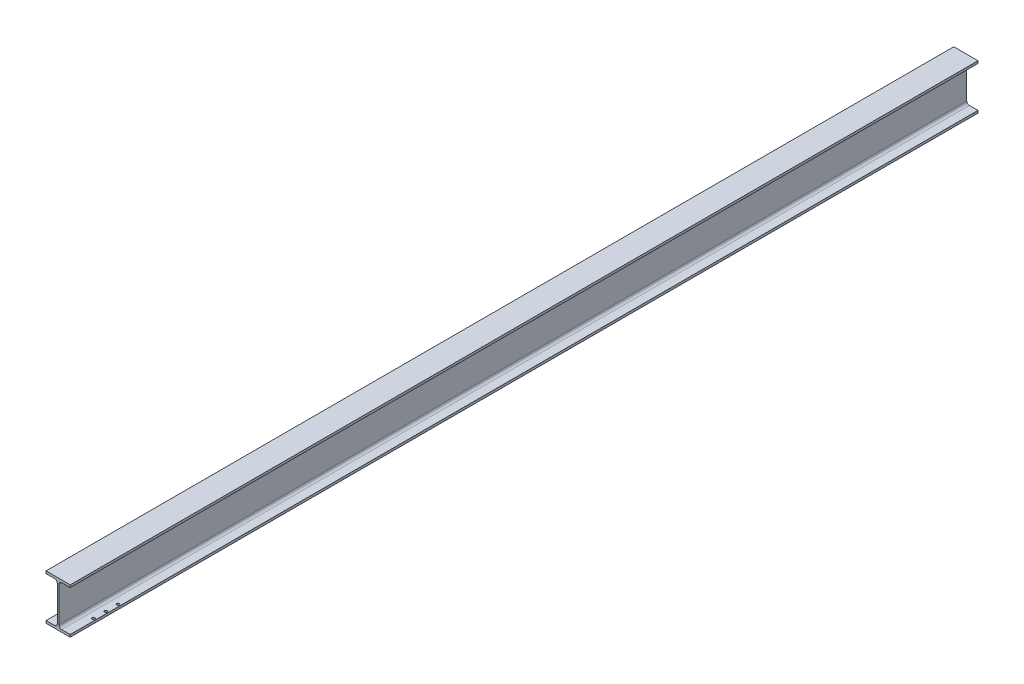
ISO-10303-21;
HEADER;
FILE_DESCRIPTION(('STEP AP214'),'2;1');
FILE_NAME('part.step','',(''),(''),'','','');
FILE_SCHEMA(('AUTOMOTIVE_DESIGN { 1 0 10303 214 1 1 1 1 }'));
ENDSEC;
DATA;
#1=APPLICATION_CONTEXT('core data for automotive mechanical design processes');
#2=APPLICATION_PROTOCOL_DEFINITION('international standard','automotive_design',2000,#1);
#3=PRODUCT_CONTEXT('',#1,'mechanical');
#4=PRODUCT('Part','Part','',(#3));
#5=PRODUCT_RELATED_PRODUCT_CATEGORY('part','',(#4));
#6=PRODUCT_DEFINITION_FORMATION('','',#4);
#7=PRODUCT_DEFINITION_CONTEXT('part definition',#1,'design');
#8=PRODUCT_DEFINITION('design','',#6,#7);
#9=PRODUCT_DEFINITION_SHAPE('','',#8);
#10=(LENGTH_UNIT() NAMED_UNIT(*) SI_UNIT(.MILLI.,.METRE.));
#11=(NAMED_UNIT(*) PLANE_ANGLE_UNIT() SI_UNIT($,.RADIAN.));
#12=(NAMED_UNIT(*) SI_UNIT($,.STERADIAN.) SOLID_ANGLE_UNIT());
#13=UNCERTAINTY_MEASURE_WITH_UNIT(LENGTH_MEASURE(1.E-05),#10,'distance_accuracy_value','');
#14=(GEOMETRIC_REPRESENTATION_CONTEXT(3) GLOBAL_UNCERTAINTY_ASSIGNED_CONTEXT((#13)) GLOBAL_UNIT_ASSIGNED_CONTEXT((#10,
#11,#12)) REPRESENTATION_CONTEXT('',''));
#15=CARTESIAN_POINT('',(0.,0.,0.));
#16=DIRECTION('',(0.,0.,1.));
#17=DIRECTION('',(1.,0.,0.));
#18=AXIS2_PLACEMENT_3D('',#15,#16,#17);
#19=CARTESIAN_POINT('',(0.,-60.,1200.));
#20=DIRECTION('',(0.,1.,0.));
#21=DIRECTION('',(-1.,0.,0.));
#22=AXIS2_PLACEMENT_3D('',#19,#20,#21);
#23=PLANE('',#22);
#24=CARTESIAN_POINT('',(25.9999999999999,-60.,1067.5));
#25=DIRECTION('',(0.,-1.,0.));
#26=DIRECTION('',(0.,0.,-1.));
#27=AXIS2_PLACEMENT_3D('',#24,#25,#26);
#28=CIRCLE('',#27,3.5);
#29=CARTESIAN_POINT('',(25.9999999999999,-60.,1064.));
#30=VERTEX_POINT('',#29);
#31=EDGE_CURVE('E561',#30,#30,#28,.T.);
#32=ORIENTED_EDGE('',*,*,#31,.F.);
#33=EDGE_LOOP('',(#32));
#34=FACE_BOUND('',#33,.T.);
#35=CARTESIAN_POINT('',(25.9999999999999,-60.,1100.));
#36=DIRECTION('',(0.,-1.,0.));
#37=DIRECTION('',(0.,0.,-1.));
#38=AXIS2_PLACEMENT_3D('',#35,#36,#37);
#39=CIRCLE('',#38,3.5);
#40=CARTESIAN_POINT('',(25.9999999999999,-60.,1096.5));
#41=VERTEX_POINT('',#40);
#42=EDGE_CURVE('E575',#41,#41,#39,.T.);
#43=ORIENTED_EDGE('',*,*,#42,.F.);
#44=EDGE_LOOP('',(#43));
#45=FACE_BOUND('',#44,.T.);
#46=DIRECTION('',(1.,0.,0.));
#47=VECTOR('',#46,1.);
#48=CARTESIAN_POINT('',(0.,-60.,-1200.));
#49=LINE('',#48,#47);
#50=CARTESIAN_POINT('',(-32.,-60.,-1200.));
#51=VERTEX_POINT('',#50);
#52=CARTESIAN_POINT('',(32.,-60.,-1200.));
#53=VERTEX_POINT('',#52);
#54=EDGE_CURVE('E163',#51,#53,#49,.T.);
#55=ORIENTED_EDGE('',*,*,#54,.T.);
#56=DIRECTION('',(0.,0.,-1.));
#57=VECTOR('',#56,1.);
#58=CARTESIAN_POINT('',(32.,-60.,1200.));
#59=LINE('',#58,#57);
#60=CARTESIAN_POINT('',(32.,-60.,1200.));
#61=VERTEX_POINT('',#60);
#62=EDGE_CURVE('E160',#61,#53,#59,.T.);
#63=ORIENTED_EDGE('',*,*,#62,.F.);
#64=DIRECTION('',(1.,0.,0.));
#65=VECTOR('',#64,1.);
#66=CARTESIAN_POINT('',(0.,-60.,1200.));
#67=LINE('',#66,#65);
#68=CARTESIAN_POINT('',(-32.,-60.,1200.));
#69=VERTEX_POINT('',#68);
#70=EDGE_CURVE('E145',#69,#61,#67,.T.);
#71=ORIENTED_EDGE('',*,*,#70,.F.);
#72=DIRECTION('',(0.,0.,-1.));
#73=VECTOR('',#72,1.);
#74=CARTESIAN_POINT('',(-32.,-60.,1200.));
#75=LINE('',#74,#73);
#76=EDGE_CURVE('E157',#69,#51,#75,.T.);
#77=ORIENTED_EDGE('',*,*,#76,.T.);
#78=EDGE_LOOP('',(#55,#63,#71,#77));
#79=FACE_BOUND('',#78,.T.);
#80=CARTESIAN_POINT('',(25.9999999999999,-60.,1132.5));
#81=DIRECTION('',(0.,-1.,0.));
#82=DIRECTION('',(0.,0.,-1.));
#83=AXIS2_PLACEMENT_3D('',#80,#81,#82);
#84=CIRCLE('',#83,3.5);
#85=CARTESIAN_POINT('',(25.9999999999999,-60.,1129.));
#86=VERTEX_POINT('',#85);
#87=EDGE_CURVE('E586',#86,#86,#84,.T.);
#88=ORIENTED_EDGE('',*,*,#87,.F.);
#89=EDGE_LOOP('',(#88));
#90=FACE_BOUND('',#89,.T.);
#91=CARTESIAN_POINT('',(-26.0000000000001,-60.,1132.5));
#92=DIRECTION('',(0.,-1.,0.));
#93=DIRECTION('',(0.,0.,-1.));
#94=AXIS2_PLACEMENT_3D('',#91,#92,#93);
#95=CIRCLE('',#94,3.5);
#96=CARTESIAN_POINT('',(-26.0000000000001,-60.,1129.));
#97=VERTEX_POINT('',#96);
#98=EDGE_CURVE('E581',#97,#97,#95,.T.);
#99=ORIENTED_EDGE('',*,*,#98,.F.);
#100=EDGE_LOOP('',(#99));
#101=FACE_BOUND('',#100,.T.);
#102=CARTESIAN_POINT('',(-26.0000000000001,-60.,1100.));
#103=DIRECTION('',(0.,-1.,0.));
#104=DIRECTION('',(0.,0.,-1.));
#105=AXIS2_PLACEMENT_3D('',#102,#103,#104);
#106=CIRCLE('',#105,3.5);
#107=CARTESIAN_POINT('',(-26.0000000000001,-60.,1096.5));
#108=VERTEX_POINT('',#107);
#109=EDGE_CURVE('E569',#108,#108,#106,.T.);
#110=ORIENTED_EDGE('',*,*,#109,.F.);
#111=EDGE_LOOP('',(#110));
#112=FACE_BOUND('',#111,.T.);
#113=CARTESIAN_POINT('',(-26.0000000000001,-60.,1067.5));
#114=DIRECTION('',(0.,-1.,0.));
#115=DIRECTION('',(0.,0.,-1.));
#116=AXIS2_PLACEMENT_3D('',#113,#114,#115);
#117=CIRCLE('',#116,3.5);
#118=CARTESIAN_POINT('',(-26.0000000000001,-60.,1064.));
#119=VERTEX_POINT('',#118);
#120=EDGE_CURVE('E558',#119,#119,#117,.T.);
#121=ORIENTED_EDGE('',*,*,#120,.F.);
#122=EDGE_LOOP('',(#121));
#123=FACE_BOUND('',#122,.T.);
#124=ADVANCED_FACE('F34',(#34,#45,#79,#90,#101,#112,#123),#23,.F.);
#125=CARTESIAN_POINT('',(-32.,60.,1200.));
#126=DIRECTION('',(0.,-1.,0.));
#127=DIRECTION('',(1.,0.,0.));
#128=AXIS2_PLACEMENT_3D('',#125,#126,#127);
#129=PLANE('',#128);
#130=DIRECTION('',(-1.,0.,0.));
#131=VECTOR('',#130,1.);
#132=CARTESIAN_POINT('',(-32.,60.,-1200.));
#133=LINE('',#132,#131);
#134=CARTESIAN_POINT('',(32.,60.,-1200.));
#135=VERTEX_POINT('',#134);
#136=CARTESIAN_POINT('',(-32.,60.,-1200.));
#137=VERTEX_POINT('',#136);
#138=EDGE_CURVE('E167',#135,#137,#133,.T.);
#139=ORIENTED_EDGE('',*,*,#138,.T.);
#140=DIRECTION('',(0.,0.,-1.));
#141=VECTOR('',#140,1.);
#142=CARTESIAN_POINT('',(-32.,60.,1200.));
#143=LINE('',#142,#141);
#144=CARTESIAN_POINT('',(-32.,60.,1200.));
#145=VERTEX_POINT('',#144);
#146=EDGE_CURVE('E242',#145,#137,#143,.T.);
#147=ORIENTED_EDGE('',*,*,#146,.F.);
#148=DIRECTION('',(-1.,0.,0.));
#149=VECTOR('',#148,1.);
#150=CARTESIAN_POINT('',(-32.,60.,1200.));
#151=LINE('',#150,#149);
#152=CARTESIAN_POINT('',(32.,60.,1200.));
#153=VERTEX_POINT('',#152);
#154=EDGE_CURVE('E208',#153,#145,#151,.T.);
#155=ORIENTED_EDGE('',*,*,#154,.F.);
#156=DIRECTION('',(0.,0.,-1.));
#157=VECTOR('',#156,1.);
#158=CARTESIAN_POINT('',(32.,60.,1200.));
#159=LINE('',#158,#157);
#160=EDGE_CURVE('E193',#153,#135,#159,.T.);
#161=ORIENTED_EDGE('',*,*,#160,.T.);
#162=EDGE_LOOP('',(#139,#147,#155,#161));
#163=FACE_BOUND('',#162,.T.);
#164=ADVANCED_FACE('F316',(#163),#129,.F.);
#165=CARTESIAN_POINT('',(-32.,53.7,1200.));
#166=DIRECTION('',(1.,0.,0.));
#167=DIRECTION('',(0.,0.,-1.));
#168=AXIS2_PLACEMENT_3D('',#165,#166,#167);
#169=PLANE('',#168);
#170=DIRECTION('',(0.,-1.,0.));
#171=VECTOR('',#170,1.);
#172=CARTESIAN_POINT('',(-32.,53.7,-1200.));
#173=LINE('',#172,#171);
#174=CARTESIAN_POINT('',(-32.,53.7,-1200.));
#175=VERTEX_POINT('',#174);
#176=EDGE_CURVE('E222',#137,#175,#173,.T.);
#177=ORIENTED_EDGE('',*,*,#176,.T.);
#178=DIRECTION('',(0.,0.,-1.));
#179=VECTOR('',#178,1.);
#180=CARTESIAN_POINT('',(-32.,53.7,1200.));
#181=LINE('',#180,#179);
#182=CARTESIAN_POINT('',(-32.,53.7,1200.));
#183=VERTEX_POINT('',#182);
#184=EDGE_CURVE('E239',#183,#175,#181,.T.);
#185=ORIENTED_EDGE('',*,*,#184,.F.);
#186=DIRECTION('',(0.,-1.,0.));
#187=VECTOR('',#186,1.);
#188=CARTESIAN_POINT('',(-32.,53.7,1200.));
#189=LINE('',#188,#187);
#190=EDGE_CURVE('E210',#145,#183,#189,.T.);
#191=ORIENTED_EDGE('',*,*,#190,.F.);
#192=ORIENTED_EDGE('',*,*,#146,.T.);
#193=EDGE_LOOP('',(#177,#185,#191,#192));
#194=FACE_BOUND('',#193,.T.);
#195=ADVANCED_FACE('F322',(#194),#169,.F.);
#196=CARTESIAN_POINT('',(-2.19999999999999,53.7,1200.));
#197=DIRECTION('',(0.,1.,0.));
#198=DIRECTION('',(0.,0.,1.));
#199=AXIS2_PLACEMENT_3D('',#196,#197,#198);
#200=PLANE('',#199);
#201=DIRECTION('',(1.,0.,0.));
#202=VECTOR('',#201,1.);
#203=CARTESIAN_POINT('',(-2.19999999999999,53.7,-1200.));
#204=LINE('',#203,#202);
#205=CARTESIAN_POINT('',(-9.19999999999999,53.7,-1200.));
#206=VERTEX_POINT('',#205);
#207=EDGE_CURVE('E224',#175,#206,#204,.T.);
#208=ORIENTED_EDGE('',*,*,#207,.T.);
#209=DIRECTION('',(0.,0.,-1.));
#210=VECTOR('',#209,1.);
#211=CARTESIAN_POINT('',(-9.19999999999999,53.7,1200.));
#212=LINE('',#211,#210);
#213=CARTESIAN_POINT('',(-9.19999999999999,53.7,1200.));
#214=VERTEX_POINT('',#213);
#215=EDGE_CURVE('E260',#206,#214,#212,.F.);
#216=ORIENTED_EDGE('',*,*,#215,.T.);
#217=DIRECTION('',(1.,0.,0.));
#218=VECTOR('',#217,1.);
#219=CARTESIAN_POINT('',(-2.19999999999999,53.7,1200.));
#220=LINE('',#219,#218);
#221=EDGE_CURVE('E212',#183,#214,#220,.T.);
#222=ORIENTED_EDGE('',*,*,#221,.F.);
#223=ORIENTED_EDGE('',*,*,#184,.T.);
#224=EDGE_LOOP('',(#208,#216,#222,#223));
#225=FACE_BOUND('',#224,.T.);
#226=ADVANCED_FACE('F325',(#225),#200,.F.);
#227=CARTESIAN_POINT('',(-2.19999999999999,-53.7,1200.));
#228=DIRECTION('',(1.,0.,0.));
#229=DIRECTION('',(0.,1.,0.));
#230=AXIS2_PLACEMENT_3D('',#227,#228,#229);
#231=PLANE('',#230);
#232=DIRECTION('',(0.,-1.,0.));
#233=VECTOR('',#232,1.);
#234=CARTESIAN_POINT('',(-2.19999999999999,-53.7,1200.));
#235=LINE('',#234,#233);
#236=CARTESIAN_POINT('',(-2.19999999999999,46.7,1200.));
#237=VERTEX_POINT('',#236);
#238=CARTESIAN_POINT('',(-2.19999999999999,-46.7,1200.));
#239=VERTEX_POINT('',#238);
#240=EDGE_CURVE('E215',#237,#239,#235,.T.);
#241=ORIENTED_EDGE('',*,*,#240,.F.);
#242=DIRECTION('',(0.,0.,-1.));
#243=VECTOR('',#242,1.);
#244=CARTESIAN_POINT('',(-2.19999999999999,46.7,-1200.));
#245=LINE('',#244,#243);
#246=CARTESIAN_POINT('',(-2.19999999999999,46.7,-1200.));
#247=VERTEX_POINT('',#246);
#248=EDGE_CURVE('E257',#237,#247,#245,.T.);
#249=ORIENTED_EDGE('',*,*,#248,.T.);
#250=DIRECTION('',(0.,-1.,0.));
#251=VECTOR('',#250,1.);
#252=CARTESIAN_POINT('',(-2.19999999999999,-53.7,-1200.));
#253=LINE('',#252,#251);
#254=CARTESIAN_POINT('',(-2.19999999999999,-46.7,-1200.));
#255=VERTEX_POINT('',#254);
#256=EDGE_CURVE('E227',#247,#255,#253,.T.);
#257=ORIENTED_EDGE('',*,*,#256,.T.);
#258=DIRECTION('',(0.,0.,-1.));
#259=VECTOR('',#258,1.);
#260=CARTESIAN_POINT('',(-2.19999999999999,-46.7,1200.));
#261=LINE('',#260,#259);
#262=EDGE_CURVE('E255',#255,#239,#261,.F.);
#263=ORIENTED_EDGE('',*,*,#262,.T.);
#264=EDGE_LOOP('',(#241,#249,#257,#263));
#265=FACE_BOUND('',#264,.T.);
#266=ADVANCED_FACE('F282',(#265),#231,.F.);
#267=CARTESIAN_POINT('',(-32.,-53.7,1200.));
#268=DIRECTION('',(0.,-1.,0.));
#269=DIRECTION('',(0.,0.,-1.));
#270=AXIS2_PLACEMENT_3D('',#267,#268,#269);
#271=PLANE('',#270);
#272=CARTESIAN_POINT('',(-26.0000000000001,-53.7,1067.5));
#273=DIRECTION('',(0.,-1.,0.));
#274=DIRECTION('',(0.,0.,-1.));
#275=AXIS2_PLACEMENT_3D('',#272,#273,#274);
#276=CIRCLE('',#275,3.5);
#277=CARTESIAN_POINT('',(-26.0000000000001,-53.7,1064.));
#278=VERTEX_POINT('',#277);
#279=EDGE_CURVE('E555',#278,#278,#276,.T.);
#280=ORIENTED_EDGE('',*,*,#279,.T.);
#281=EDGE_LOOP('',(#280));
#282=FACE_BOUND('',#281,.T.);
#283=CARTESIAN_POINT('',(-26.0000000000001,-53.7,1100.));
#284=DIRECTION('',(0.,-1.,0.));
#285=DIRECTION('',(0.,0.,-1.));
#286=AXIS2_PLACEMENT_3D('',#283,#284,#285);
#287=CIRCLE('',#286,3.5);
#288=CARTESIAN_POINT('',(-26.0000000000001,-53.7,1096.5));
#289=VERTEX_POINT('',#288);
#290=EDGE_CURVE('E572',#289,#289,#287,.T.);
#291=ORIENTED_EDGE('',*,*,#290,.T.);
#292=EDGE_LOOP('',(#291));
#293=FACE_BOUND('',#292,.T.);
#294=CARTESIAN_POINT('',(-26.0000000000001,-53.7,1132.5));
#295=DIRECTION('',(0.,-1.,0.));
#296=DIRECTION('',(0.,0.,-1.));
#297=AXIS2_PLACEMENT_3D('',#294,#295,#296);
#298=CIRCLE('',#297,3.5);
#299=CARTESIAN_POINT('',(-26.0000000000001,-53.7,1129.));
#300=VERTEX_POINT('',#299);
#301=EDGE_CURVE('E584',#300,#300,#298,.T.);
#302=ORIENTED_EDGE('',*,*,#301,.T.);
#303=EDGE_LOOP('',(#302));
#304=FACE_BOUND('',#303,.T.);
#305=DIRECTION('',(-1.,0.,0.));
#306=VECTOR('',#305,1.);
#307=CARTESIAN_POINT('',(-32.,-53.7,1200.));
#308=LINE('',#307,#306);
#309=CARTESIAN_POINT('',(-9.19999999999999,-53.7,1200.));
#310=VERTEX_POINT('',#309);
#311=CARTESIAN_POINT('',(-32.,-53.7,1200.));
#312=VERTEX_POINT('',#311);
#313=EDGE_CURVE('E217',#310,#312,#308,.T.);
#314=ORIENTED_EDGE('',*,*,#313,.F.);
#315=DIRECTION('',(0.,0.,-1.));
#316=VECTOR('',#315,1.);
#317=CARTESIAN_POINT('',(-9.19999999999999,-53.7,-1200.));
#318=LINE('',#317,#316);
#319=CARTESIAN_POINT('',(-9.19999999999999,-53.7,-1200.));
#320=VERTEX_POINT('',#319);
#321=EDGE_CURVE('E262',#310,#320,#318,.T.);
#322=ORIENTED_EDGE('',*,*,#321,.T.);
#323=DIRECTION('',(-1.,0.,0.));
#324=VECTOR('',#323,1.);
#325=CARTESIAN_POINT('',(-32.,-53.7,-1200.));
#326=LINE('',#325,#324);
#327=CARTESIAN_POINT('',(-32.,-53.7,-1200.));
#328=VERTEX_POINT('',#327);
#329=EDGE_CURVE('E230',#320,#328,#326,.T.);
#330=ORIENTED_EDGE('',*,*,#329,.T.);
#331=DIRECTION('',(0.,0.,-1.));
#332=VECTOR('',#331,1.);
#333=CARTESIAN_POINT('',(-32.,-53.7,1200.));
#334=LINE('',#333,#332);
#335=EDGE_CURVE('E236',#312,#328,#334,.T.);
#336=ORIENTED_EDGE('',*,*,#335,.F.);
#337=EDGE_LOOP('',(#314,#322,#330,#336));
#338=FACE_BOUND('',#337,.T.);
#339=ADVANCED_FACE('F285',(#282,#293,#304,#338),#271,.F.);
#340=CARTESIAN_POINT('',(-32.,-60.,1200.));
#341=DIRECTION('',(1.,0.,0.));
#342=DIRECTION('',(0.,0.,-1.));
#343=AXIS2_PLACEMENT_3D('',#340,#341,#342);
#344=PLANE('',#343);
#345=DIRECTION('',(0.,-1.,0.));
#346=VECTOR('',#345,1.);
#347=CARTESIAN_POINT('',(-32.,-60.,-1200.));
#348=LINE('',#347,#346);
#349=EDGE_CURVE('E232',#328,#51,#348,.T.);
#350=ORIENTED_EDGE('',*,*,#349,.T.);
#351=ORIENTED_EDGE('',*,*,#76,.F.);
#352=DIRECTION('',(0.,-1.,0.));
#353=VECTOR('',#352,1.);
#354=CARTESIAN_POINT('',(-32.,-60.,1200.));
#355=LINE('',#354,#353);
#356=EDGE_CURVE('E153',#312,#69,#355,.T.);
#357=ORIENTED_EDGE('',*,*,#356,.F.);
#358=ORIENTED_EDGE('',*,*,#335,.T.);
#359=EDGE_LOOP('',(#350,#351,#357,#358));
#360=FACE_BOUND('',#359,.T.);
#361=ADVANCED_FACE('F288',(#360),#344,.F.);
#362=CARTESIAN_POINT('',(0.,0.,1200.));
#363=DIRECTION('',(0.,0.,-1.));
#364=DIRECTION('',(-1.,0.,0.));
#365=AXIS2_PLACEMENT_3D('',#362,#363,#364);
#366=PLANE('',#365);
#367=ORIENTED_EDGE('',*,*,#154,.T.);
#368=ORIENTED_EDGE('',*,*,#190,.T.);
#369=ORIENTED_EDGE('',*,*,#221,.T.);
#370=CARTESIAN_POINT('',(-9.19999999999999,46.7,1200.));
#371=DIRECTION('',(0.,0.,-1.));
#372=DIRECTION('',(-1.,0.,0.));
#373=AXIS2_PLACEMENT_3D('',#370,#371,#372);
#374=CIRCLE('',#373,7.);
#375=EDGE_CURVE('E274',#214,#237,#374,.T.);
#376=ORIENTED_EDGE('',*,*,#375,.T.);
#377=ORIENTED_EDGE('',*,*,#240,.T.);
#378=CARTESIAN_POINT('',(-9.19999999999999,-46.7,1200.));
#379=DIRECTION('',(0.,0.,-1.));
#380=DIRECTION('',(-1.,0.,0.));
#381=AXIS2_PLACEMENT_3D('',#378,#379,#380);
#382=CIRCLE('',#381,7.);
#383=EDGE_CURVE('E11',#239,#310,#382,.T.);
#384=ORIENTED_EDGE('',*,*,#383,.T.);
#385=ORIENTED_EDGE('',*,*,#313,.T.);
#386=ORIENTED_EDGE('',*,*,#356,.T.);
#387=ORIENTED_EDGE('',*,*,#70,.T.);
#388=DIRECTION('',(0.,-1.,0.));
#389=VECTOR('',#388,1.);
#390=CARTESIAN_POINT('',(32.,-60.,1200.));
#391=LINE('',#390,#389);
#392=CARTESIAN_POINT('',(32.,-53.7,1200.));
#393=VERTEX_POINT('',#392);
#394=EDGE_CURVE('E151',#393,#61,#391,.T.);
#395=ORIENTED_EDGE('',*,*,#394,.F.);
#396=DIRECTION('',(1.,0.,0.));
#397=VECTOR('',#396,1.);
#398=CARTESIAN_POINT('',(32.,-53.7,1200.));
#399=LINE('',#398,#397);
#400=CARTESIAN_POINT('',(9.20000000000001,-53.7,1200.));
#401=VERTEX_POINT('',#400);
#402=EDGE_CURVE('E173',#401,#393,#399,.T.);
#403=ORIENTED_EDGE('',*,*,#402,.F.);
#404=CARTESIAN_POINT('',(9.2,-46.7,1200.));
#405=DIRECTION('',(0.,0.,-1.));
#406=DIRECTION('',(-1.,0.,0.));
#407=AXIS2_PLACEMENT_3D('',#404,#405,#406);
#408=CIRCLE('',#407,7.);
#409=CARTESIAN_POINT('',(2.2,-46.7,1200.));
#410=VERTEX_POINT('',#409);
#411=EDGE_CURVE('E266',#401,#410,#408,.T.);
#412=ORIENTED_EDGE('',*,*,#411,.T.);
#413=DIRECTION('',(0.,-1.,0.));
#414=VECTOR('',#413,1.);
#415=CARTESIAN_POINT('',(2.2,-53.7,1200.));
#416=LINE('',#415,#414);
#417=CARTESIAN_POINT('',(2.19999999999997,46.7,1200.));
#418=VERTEX_POINT('',#417);
#419=EDGE_CURVE('E176',#418,#410,#416,.T.);
#420=ORIENTED_EDGE('',*,*,#419,.F.);
#421=CARTESIAN_POINT('',(9.19999999999997,46.7,1200.));
#422=DIRECTION('',(0.,0.,-1.));
#423=DIRECTION('',(-1.,0.,0.));
#424=AXIS2_PLACEMENT_3D('',#421,#422,#423);
#425=CIRCLE('',#424,7.);
#426=CARTESIAN_POINT('',(9.19999999999997,53.7,1200.));
#427=VERTEX_POINT('',#426);
#428=EDGE_CURVE('E270',#418,#427,#425,.T.);
#429=ORIENTED_EDGE('',*,*,#428,.T.);
#430=DIRECTION('',(-1.,0.,0.));
#431=VECTOR('',#430,1.);
#432=CARTESIAN_POINT('',(2.19999999999997,53.7,1200.));
#433=LINE('',#432,#431);
#434=CARTESIAN_POINT('',(32.,53.7,1200.));
#435=VERTEX_POINT('',#434);
#436=EDGE_CURVE('E187',#435,#427,#433,.T.);
#437=ORIENTED_EDGE('',*,*,#436,.F.);
#438=DIRECTION('',(0.,-1.,0.));
#439=VECTOR('',#438,1.);
#440=CARTESIAN_POINT('',(32.,53.7,1200.));
#441=LINE('',#440,#439);
#442=EDGE_CURVE('E190',#153,#435,#441,.T.);
#443=ORIENTED_EDGE('',*,*,#442,.F.);
#444=EDGE_LOOP('',(#367,#368,#369,#376,#377,#384,#385,#386,#387,#395,#403,#412,#420,#429,#437,#443));
#445=FACE_BOUND('',#444,.T.);
#446=ADVANCED_FACE('F148',(#445),#366,.F.);
#447=CARTESIAN_POINT('',(0.,0.,-1200.));
#448=DIRECTION('',(0.,0.,-1.));
#449=DIRECTION('',(-1.,0.,0.));
#450=AXIS2_PLACEMENT_3D('',#447,#448,#449);
#451=PLANE('',#450);
#452=ORIENTED_EDGE('',*,*,#138,.F.);
#453=DIRECTION('',(0.,-1.,0.));
#454=VECTOR('',#453,1.);
#455=CARTESIAN_POINT('',(32.,53.7,-1200.));
#456=LINE('',#455,#454);
#457=CARTESIAN_POINT('',(32.,53.7,-1200.));
#458=VERTEX_POINT('',#457);
#459=EDGE_CURVE('E174',#135,#458,#456,.T.);
#460=ORIENTED_EDGE('',*,*,#459,.T.);
#461=DIRECTION('',(-1.,0.,0.));
#462=VECTOR('',#461,1.);
#463=CARTESIAN_POINT('',(2.19999999999997,53.7,-1200.));
#464=LINE('',#463,#462);
#465=CARTESIAN_POINT('',(9.19999999999997,53.7,-1200.));
#466=VERTEX_POINT('',#465);
#467=EDGE_CURVE('E179',#458,#466,#464,.T.);
#468=ORIENTED_EDGE('',*,*,#467,.T.);
#469=CARTESIAN_POINT('',(9.19999999999997,46.7,-1200.));
#470=DIRECTION('',(0.,0.,-1.));
#471=DIRECTION('',(-1.,0.,0.));
#472=AXIS2_PLACEMENT_3D('',#469,#470,#471);
#473=CIRCLE('',#472,7.);
#474=CARTESIAN_POINT('',(2.19999999999997,46.7,-1200.));
#475=VERTEX_POINT('',#474);
#476=EDGE_CURVE('E268',#466,#475,#473,.F.);
#477=ORIENTED_EDGE('',*,*,#476,.T.);
#478=DIRECTION('',(0.,-1.,0.));
#479=VECTOR('',#478,1.);
#480=CARTESIAN_POINT('',(2.2,-53.7,-1200.));
#481=LINE('',#480,#479);
#482=CARTESIAN_POINT('',(2.2,-46.7,-1200.));
#483=VERTEX_POINT('',#482);
#484=EDGE_CURVE('E198',#475,#483,#481,.T.);
#485=ORIENTED_EDGE('',*,*,#484,.T.);
#486=CARTESIAN_POINT('',(9.2,-46.7,-1200.));
#487=DIRECTION('',(0.,0.,-1.));
#488=DIRECTION('',(-1.,0.,0.));
#489=AXIS2_PLACEMENT_3D('',#486,#487,#488);
#490=CIRCLE('',#489,7.);
#491=CARTESIAN_POINT('',(9.20000000000001,-53.7,-1200.));
#492=VERTEX_POINT('',#491);
#493=EDGE_CURVE('E264',#483,#492,#490,.F.);
#494=ORIENTED_EDGE('',*,*,#493,.T.);
#495=DIRECTION('',(1.,0.,0.));
#496=VECTOR('',#495,1.);
#497=CARTESIAN_POINT('',(32.,-53.7,-1200.));
#498=LINE('',#497,#496);
#499=CARTESIAN_POINT('',(32.,-53.7,-1200.));
#500=VERTEX_POINT('',#499);
#501=EDGE_CURVE('E196',#492,#500,#498,.T.);
#502=ORIENTED_EDGE('',*,*,#501,.T.);
#503=DIRECTION('',(0.,-1.,0.));
#504=VECTOR('',#503,1.);
#505=CARTESIAN_POINT('',(32.,-60.,-1200.));
#506=LINE('',#505,#504);
#507=EDGE_CURVE('E194',#500,#53,#506,.T.);
#508=ORIENTED_EDGE('',*,*,#507,.T.);
#509=ORIENTED_EDGE('',*,*,#54,.F.);
#510=ORIENTED_EDGE('',*,*,#349,.F.);
#511=ORIENTED_EDGE('',*,*,#329,.F.);
#512=CARTESIAN_POINT('',(-9.19999999999999,-46.7,-1200.));
#513=DIRECTION('',(0.,0.,-1.));
#514=DIRECTION('',(-1.,0.,0.));
#515=AXIS2_PLACEMENT_3D('',#512,#513,#514);
#516=CIRCLE('',#515,7.);
#517=EDGE_CURVE('E42',#320,#255,#516,.F.);
#518=ORIENTED_EDGE('',*,*,#517,.T.);
#519=ORIENTED_EDGE('',*,*,#256,.F.);
#520=CARTESIAN_POINT('',(-9.19999999999999,46.7,-1200.));
#521=DIRECTION('',(0.,0.,-1.));
#522=DIRECTION('',(-1.,0.,0.));
#523=AXIS2_PLACEMENT_3D('',#520,#521,#522);
#524=CIRCLE('',#523,7.);
#525=EDGE_CURVE('E272',#247,#206,#524,.F.);
#526=ORIENTED_EDGE('',*,*,#525,.T.);
#527=ORIENTED_EDGE('',*,*,#207,.F.);
#528=ORIENTED_EDGE('',*,*,#176,.F.);
#529=EDGE_LOOP('',(#452,#460,#468,#477,#485,#494,#502,#508,#509,#510,#511,#518,#519,#526,#527,#528));
#530=FACE_BOUND('',#529,.T.);
#531=ADVANCED_FACE('F278',(#530),#451,.T.);
#532=CARTESIAN_POINT('',(32.,-60.,1200.));
#533=DIRECTION('',(1.,0.,0.));
#534=DIRECTION('',(0.,1.,0.));
#535=AXIS2_PLACEMENT_3D('',#532,#533,#534);
#536=PLANE('',#535);
#537=ORIENTED_EDGE('',*,*,#507,.F.);
#538=DIRECTION('',(0.,0.,-1.));
#539=VECTOR('',#538,1.);
#540=CARTESIAN_POINT('',(32.,-53.7,1200.));
#541=LINE('',#540,#539);
#542=EDGE_CURVE('E168',#393,#500,#541,.T.);
#543=ORIENTED_EDGE('',*,*,#542,.F.);
#544=ORIENTED_EDGE('',*,*,#394,.T.);
#545=ORIENTED_EDGE('',*,*,#62,.T.);
#546=EDGE_LOOP('',(#537,#543,#544,#545));
#547=FACE_BOUND('',#546,.T.);
#548=ADVANCED_FACE('F171',(#547),#536,.T.);
#549=CARTESIAN_POINT('',(32.,-53.7,1200.));
#550=DIRECTION('',(0.,1.,0.));
#551=DIRECTION('',(-1.,0.,0.));
#552=AXIS2_PLACEMENT_3D('',#549,#550,#551);
#553=PLANE('',#552);
#554=CARTESIAN_POINT('',(25.9999999999999,-53.7,1067.5));
#555=DIRECTION('',(0.,1.,0.));
#556=DIRECTION('',(-1.,0.,0.));
#557=AXIS2_PLACEMENT_3D('',#554,#555,#556);
#558=CIRCLE('',#557,3.5);
#559=CARTESIAN_POINT('',(22.4999999999999,-53.7,1067.5));
#560=VERTEX_POINT('',#559);
#561=EDGE_CURVE('E566',#560,#560,#558,.T.);
#562=ORIENTED_EDGE('',*,*,#561,.F.);
#563=EDGE_LOOP('',(#562));
#564=FACE_BOUND('',#563,.T.);
#565=CARTESIAN_POINT('',(25.9999999999999,-53.7,1100.));
#566=DIRECTION('',(0.,1.,0.));
#567=DIRECTION('',(-1.,0.,0.));
#568=AXIS2_PLACEMENT_3D('',#565,#566,#567);
#569=CIRCLE('',#568,3.5);
#570=CARTESIAN_POINT('',(22.4999999999999,-53.7,1100.));
#571=VERTEX_POINT('',#570);
#572=EDGE_CURVE('E578',#571,#571,#569,.T.);
#573=ORIENTED_EDGE('',*,*,#572,.F.);
#574=EDGE_LOOP('',(#573));
#575=FACE_BOUND('',#574,.T.);
#576=CARTESIAN_POINT('',(25.9999999999999,-53.7,1132.5));
#577=DIRECTION('',(0.,1.,0.));
#578=DIRECTION('',(-1.,0.,0.));
#579=AXIS2_PLACEMENT_3D('',#576,#577,#578);
#580=CIRCLE('',#579,3.5);
#581=CARTESIAN_POINT('',(22.4999999999999,-53.7,1132.5));
#582=VERTEX_POINT('',#581);
#583=EDGE_CURVE('E182',#582,#582,#580,.T.);
#584=ORIENTED_EDGE('',*,*,#583,.F.);
#585=EDGE_LOOP('',(#584));
#586=FACE_BOUND('',#585,.T.);
#587=ORIENTED_EDGE('',*,*,#501,.F.);
#588=DIRECTION('',(0.,0.,-1.));
#589=VECTOR('',#588,1.);
#590=CARTESIAN_POINT('',(9.2,-53.7,1200.));
#591=LINE('',#590,#589);
#592=EDGE_CURVE('E250',#492,#401,#591,.F.);
#593=ORIENTED_EDGE('',*,*,#592,.T.);
#594=ORIENTED_EDGE('',*,*,#402,.T.);
#595=ORIENTED_EDGE('',*,*,#542,.T.);
#596=EDGE_LOOP('',(#587,#593,#594,#595));
#597=FACE_BOUND('',#596,.T.);
#598=ADVANCED_FACE('F292',(#564,#575,#586,#597),#553,.T.);
#599=CARTESIAN_POINT('',(2.2,-53.7,1200.));
#600=DIRECTION('',(1.,0.,0.));
#601=DIRECTION('',(0.,1.,0.));
#602=AXIS2_PLACEMENT_3D('',#599,#600,#601);
#603=PLANE('',#602);
#604=ORIENTED_EDGE('',*,*,#419,.T.);
#605=DIRECTION('',(0.,0.,-1.));
#606=VECTOR('',#605,1.);
#607=CARTESIAN_POINT('',(2.2,-46.7,-1200.));
#608=LINE('',#607,#606);
#609=EDGE_CURVE('E247',#410,#483,#608,.T.);
#610=ORIENTED_EDGE('',*,*,#609,.T.);
#611=ORIENTED_EDGE('',*,*,#484,.F.);
#612=DIRECTION('',(0.,0.,-1.));
#613=VECTOR('',#612,1.);
#614=CARTESIAN_POINT('',(2.19999999999997,46.7,1200.));
#615=LINE('',#614,#613);
#616=EDGE_CURVE('E245',#475,#418,#615,.F.);
#617=ORIENTED_EDGE('',*,*,#616,.T.);
#618=EDGE_LOOP('',(#604,#610,#611,#617));
#619=FACE_BOUND('',#618,.T.);
#620=ADVANCED_FACE('F300',(#619),#603,.T.);
#621=CARTESIAN_POINT('',(2.19999999999997,53.7,1200.));
#622=DIRECTION('',(0.,-1.,0.));
#623=DIRECTION('',(1.,0.,0.));
#624=AXIS2_PLACEMENT_3D('',#621,#622,#623);
#625=PLANE('',#624);
#626=ORIENTED_EDGE('',*,*,#436,.T.);
#627=DIRECTION('',(0.,0.,-1.));
#628=VECTOR('',#627,1.);
#629=CARTESIAN_POINT('',(9.19999999999997,53.7,-1200.));
#630=LINE('',#629,#628);
#631=EDGE_CURVE('E252',#427,#466,#630,.T.);
#632=ORIENTED_EDGE('',*,*,#631,.T.);
#633=ORIENTED_EDGE('',*,*,#467,.F.);
#634=DIRECTION('',(0.,0.,-1.));
#635=VECTOR('',#634,1.);
#636=CARTESIAN_POINT('',(32.,53.7,1200.));
#637=LINE('',#636,#635);
#638=EDGE_CURVE('E205',#435,#458,#637,.T.);
#639=ORIENTED_EDGE('',*,*,#638,.F.);
#640=EDGE_LOOP('',(#626,#632,#633,#639));
#641=FACE_BOUND('',#640,.T.);
#642=ADVANCED_FACE('F308',(#641),#625,.T.);
#643=CARTESIAN_POINT('',(32.,53.7,1200.));
#644=DIRECTION('',(1.,0.,0.));
#645=DIRECTION('',(0.,1.,0.));
#646=AXIS2_PLACEMENT_3D('',#643,#644,#645);
#647=PLANE('',#646);
#648=ORIENTED_EDGE('',*,*,#459,.F.);
#649=ORIENTED_EDGE('',*,*,#160,.F.);
#650=ORIENTED_EDGE('',*,*,#442,.T.);
#651=ORIENTED_EDGE('',*,*,#638,.T.);
#652=EDGE_LOOP('',(#648,#649,#650,#651));
#653=FACE_BOUND('',#652,.T.);
#654=ADVANCED_FACE('F314',(#653),#647,.T.);
#655=CARTESIAN_POINT('',(9.2,-46.7,1200.));
#656=DIRECTION('',(0.,0.,1.));
#657=DIRECTION('',(1.,0.,0.));
#658=AXIS2_PLACEMENT_3D('',#655,#656,#657);
#659=CYLINDRICAL_SURFACE('',#658,7.);
#660=ORIENTED_EDGE('',*,*,#411,.F.);
#661=ORIENTED_EDGE('',*,*,#592,.F.);
#662=ORIENTED_EDGE('',*,*,#493,.F.);
#663=ORIENTED_EDGE('',*,*,#609,.F.);
#664=EDGE_LOOP('',(#660,#661,#662,#663));
#665=FACE_BOUND('',#664,.T.);
#666=ADVANCED_FACE('F297',(#665),#659,.F.);
#667=CARTESIAN_POINT('',(9.19999999999997,46.7,1200.));
#668=DIRECTION('',(0.,0.,1.));
#669=DIRECTION('',(1.,0.,0.));
#670=AXIS2_PLACEMENT_3D('',#667,#668,#669);
#671=CYLINDRICAL_SURFACE('',#670,7.);
#672=ORIENTED_EDGE('',*,*,#428,.F.);
#673=ORIENTED_EDGE('',*,*,#616,.F.);
#674=ORIENTED_EDGE('',*,*,#476,.F.);
#675=ORIENTED_EDGE('',*,*,#631,.F.);
#676=EDGE_LOOP('',(#672,#673,#674,#675));
#677=FACE_BOUND('',#676,.T.);
#678=ADVANCED_FACE('F306',(#677),#671,.F.);
#679=CARTESIAN_POINT('',(-9.19999999999999,46.7,1200.));
#680=DIRECTION('',(0.,0.,1.));
#681=DIRECTION('',(1.,0.,0.));
#682=AXIS2_PLACEMENT_3D('',#679,#680,#681);
#683=CYLINDRICAL_SURFACE('',#682,7.);
#684=ORIENTED_EDGE('',*,*,#375,.F.);
#685=ORIENTED_EDGE('',*,*,#215,.F.);
#686=ORIENTED_EDGE('',*,*,#525,.F.);
#687=ORIENTED_EDGE('',*,*,#248,.F.);
#688=EDGE_LOOP('',(#684,#685,#686,#687));
#689=FACE_BOUND('',#688,.T.);
#690=ADVANCED_FACE('F328',(#689),#683,.F.);
#691=CARTESIAN_POINT('',(-9.19999999999999,-46.7,1200.));
#692=DIRECTION('',(0.,0.,1.));
#693=DIRECTION('',(1.,0.,0.));
#694=AXIS2_PLACEMENT_3D('',#691,#692,#693);
#695=CYLINDRICAL_SURFACE('',#694,7.);
#696=ORIENTED_EDGE('',*,*,#383,.F.);
#697=ORIENTED_EDGE('',*,*,#262,.F.);
#698=ORIENTED_EDGE('',*,*,#517,.F.);
#699=ORIENTED_EDGE('',*,*,#321,.F.);
#700=EDGE_LOOP('',(#696,#697,#698,#699));
#701=FACE_BOUND('',#700,.T.);
#702=ADVANCED_FACE('F36',(#701),#695,.F.);
#703=CARTESIAN_POINT('',(25.9999999999999,-60.,1132.5));
#704=DIRECTION('',(0.,-1.,0.));
#705=DIRECTION('',(0.,0.,-1.));
#706=AXIS2_PLACEMENT_3D('',#703,#704,#705);
#707=CYLINDRICAL_SURFACE('',#706,3.5);
#708=ORIENTED_EDGE('',*,*,#87,.T.);
#709=EDGE_LOOP('',(#708));
#710=FACE_BOUND('',#709,.T.);
#711=ORIENTED_EDGE('',*,*,#583,.T.);
#712=EDGE_LOOP('',(#711));
#713=FACE_BOUND('',#712,.T.);
#714=ADVANCED_FACE('F334',(#710,#713),#707,.F.);
#715=CARTESIAN_POINT('',(-26.0000000000001,-60.,1132.5));
#716=DIRECTION('',(0.,-1.,0.));
#717=DIRECTION('',(0.,0.,-1.));
#718=AXIS2_PLACEMENT_3D('',#715,#716,#717);
#719=CYLINDRICAL_SURFACE('',#718,3.5);
#720=ORIENTED_EDGE('',*,*,#301,.F.);
#721=EDGE_LOOP('',(#720));
#722=FACE_BOUND('',#721,.T.);
#723=ORIENTED_EDGE('',*,*,#98,.T.);
#724=EDGE_LOOP('',(#723));
#725=FACE_BOUND('',#724,.T.);
#726=ADVANCED_FACE('F431',(#722,#725),#719,.F.);
#727=CARTESIAN_POINT('',(25.9999999999999,-60.,1100.));
#728=DIRECTION('',(0.,-1.,0.));
#729=DIRECTION('',(0.,0.,-1.));
#730=AXIS2_PLACEMENT_3D('',#727,#728,#729);
#731=CYLINDRICAL_SURFACE('',#730,3.5);
#732=ORIENTED_EDGE('',*,*,#42,.T.);
#733=EDGE_LOOP('',(#732));
#734=FACE_BOUND('',#733,.T.);
#735=ORIENTED_EDGE('',*,*,#572,.T.);
#736=EDGE_LOOP('',(#735));
#737=FACE_BOUND('',#736,.T.);
#738=ADVANCED_FACE('F510',(#734,#737),#731,.F.);
#739=CARTESIAN_POINT('',(-26.0000000000001,-60.,1100.));
#740=DIRECTION('',(0.,-1.,0.));
#741=DIRECTION('',(0.,0.,-1.));
#742=AXIS2_PLACEMENT_3D('',#739,#740,#741);
#743=CYLINDRICAL_SURFACE('',#742,3.5);
#744=ORIENTED_EDGE('',*,*,#290,.F.);
#745=EDGE_LOOP('',(#744));
#746=FACE_BOUND('',#745,.T.);
#747=ORIENTED_EDGE('',*,*,#109,.T.);
#748=EDGE_LOOP('',(#747));
#749=FACE_BOUND('',#748,.T.);
#750=ADVANCED_FACE('F518',(#746,#749),#743,.F.);
#751=CARTESIAN_POINT('',(25.9999999999999,-60.,1067.5));
#752=DIRECTION('',(0.,-1.,0.));
#753=DIRECTION('',(0.,0.,-1.));
#754=AXIS2_PLACEMENT_3D('',#751,#752,#753);
#755=CYLINDRICAL_SURFACE('',#754,3.5);
#756=ORIENTED_EDGE('',*,*,#31,.T.);
#757=EDGE_LOOP('',(#756));
#758=FACE_BOUND('',#757,.T.);
#759=ORIENTED_EDGE('',*,*,#561,.T.);
#760=EDGE_LOOP('',(#759));
#761=FACE_BOUND('',#760,.T.);
#762=ADVANCED_FACE('F527',(#758,#761),#755,.F.);
#763=CARTESIAN_POINT('',(-26.0000000000001,-60.,1067.5));
#764=DIRECTION('',(0.,-1.,0.));
#765=DIRECTION('',(0.,0.,-1.));
#766=AXIS2_PLACEMENT_3D('',#763,#764,#765);
#767=CYLINDRICAL_SURFACE('',#766,3.5);
#768=ORIENTED_EDGE('',*,*,#279,.F.);
#769=EDGE_LOOP('',(#768));
#770=FACE_BOUND('',#769,.T.);
#771=ORIENTED_EDGE('',*,*,#120,.T.);
#772=EDGE_LOOP('',(#771));
#773=FACE_BOUND('',#772,.T.);
#774=ADVANCED_FACE('F536',(#770,#773),#767,.F.);
#775=CLOSED_SHELL('',(#124,#164,#195,#226,#266,#339,#361,#446,#531,#548,#598,#620,#642,#654,
#666,#678,#690,#702,#714,#726,#738,#750,#762,#774));
#776=MANIFOLD_SOLID_BREP('B2',#775);
#777=ADVANCED_BREP_SHAPE_REPRESENTATION('',(#18,#776),#14);
#778=SHAPE_DEFINITION_REPRESENTATION(#9,#777);
ENDSEC;
END-ISO-10303-21;
